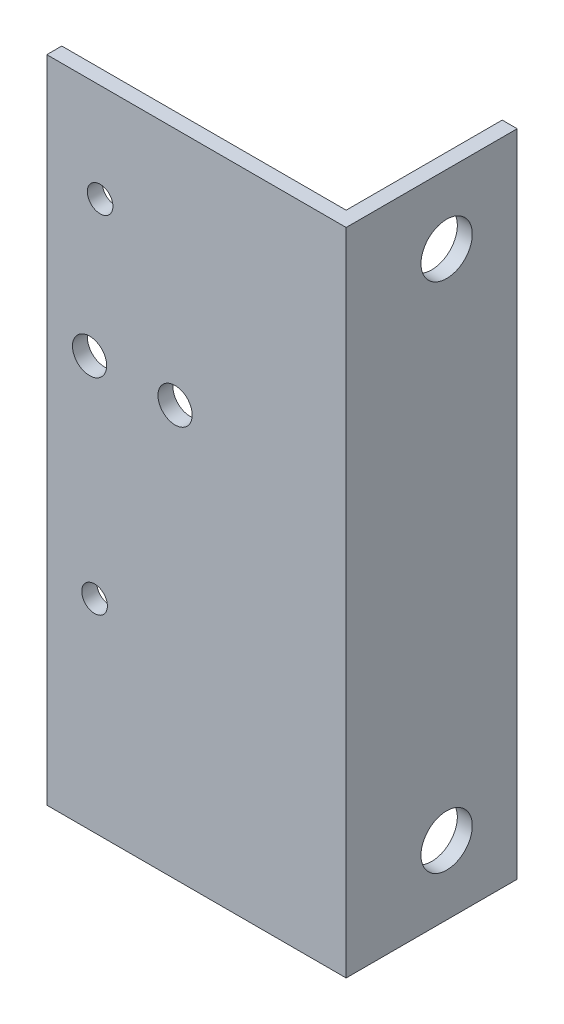
ISO-10303-21;
HEADER;
FILE_DESCRIPTION(('STEP AP214'),'2;1');
FILE_NAME('part.step','',(''),(''),'','','');
FILE_SCHEMA(('AUTOMOTIVE_DESIGN { 1 0 10303 214 1 1 1 1 }'));
ENDSEC;
DATA;
#1=APPLICATION_CONTEXT('core data for automotive mechanical design processes');
#2=APPLICATION_PROTOCOL_DEFINITION('international standard','automotive_design',2000,#1);
#3=PRODUCT_CONTEXT('',#1,'mechanical');
#4=PRODUCT('Part','Part','',(#3));
#5=PRODUCT_RELATED_PRODUCT_CATEGORY('part','',(#4));
#6=PRODUCT_DEFINITION_FORMATION('','',#4);
#7=PRODUCT_DEFINITION_CONTEXT('part definition',#1,'design');
#8=PRODUCT_DEFINITION('design','',#6,#7);
#9=PRODUCT_DEFINITION_SHAPE('','',#8);
#10=(LENGTH_UNIT() NAMED_UNIT(*) SI_UNIT(.MILLI.,.METRE.));
#11=(NAMED_UNIT(*) PLANE_ANGLE_UNIT() SI_UNIT($,.RADIAN.));
#12=(NAMED_UNIT(*) SI_UNIT($,.STERADIAN.) SOLID_ANGLE_UNIT());
#13=UNCERTAINTY_MEASURE_WITH_UNIT(LENGTH_MEASURE(1.E-05),#10,'distance_accuracy_value','');
#14=(GEOMETRIC_REPRESENTATION_CONTEXT(3) GLOBAL_UNCERTAINTY_ASSIGNED_CONTEXT((#13)) GLOBAL_UNIT_ASSIGNED_CONTEXT((#10,
#11,#12)) REPRESENTATION_CONTEXT('',''));
#15=CARTESIAN_POINT('',(0.,0.,0.));
#16=DIRECTION('',(0.,0.,1.));
#17=DIRECTION('',(1.,0.,0.));
#18=AXIS2_PLACEMENT_3D('',#15,#16,#17);
#19=CARTESIAN_POINT('',(0.,76.,1.75));
#20=DIRECTION('',(-1.,0.,0.));
#21=DIRECTION('',(0.,0.,1.));
#22=AXIS2_PLACEMENT_3D('',#19,#20,#21);
#23=PLANE('',#22);
#24=CARTESIAN_POINT('',(0.,67.9549999999984,-9.99999999999945));
#25=DIRECTION('',(-1.,0.,0.));
#26=DIRECTION('',(0.,0.,1.));
#27=AXIS2_PLACEMENT_3D('',#24,#25,#26);
#28=CIRCLE('',#27,3.);
#29=CARTESIAN_POINT('',(0.,67.9549999999984,-6.99999999999945));
#30=VERTEX_POINT('',#29);
#31=EDGE_CURVE('E200',#30,#30,#28,.F.);
#32=ORIENTED_EDGE('',*,*,#31,.F.);
#33=EDGE_LOOP('',(#32));
#34=FACE_BOUND('',#33,.T.);
#35=CARTESIAN_POINT('',(0.,8.05,-9.99999999999945));
#36=DIRECTION('',(-1.,0.,0.));
#37=DIRECTION('',(0.,0.,1.));
#38=AXIS2_PLACEMENT_3D('',#35,#36,#37);
#39=CIRCLE('',#38,3.);
#40=CARTESIAN_POINT('',(0.,8.05,-6.99999999999945));
#41=VERTEX_POINT('',#40);
#42=EDGE_CURVE('E149',#41,#41,#39,.F.);
#43=ORIENTED_EDGE('',*,*,#42,.F.);
#44=EDGE_LOOP('',(#43));
#45=FACE_BOUND('',#44,.T.);
#46=DIRECTION('',(0.,0.,-1.));
#47=VECTOR('',#46,1.);
#48=CARTESIAN_POINT('',(0.,0.,1.75));
#49=LINE('',#48,#47);
#50=CARTESIAN_POINT('',(0.,0.,1.75));
#51=VERTEX_POINT('',#50);
#52=CARTESIAN_POINT('',(0.,0.,-18.25));
#53=VERTEX_POINT('',#52);
#54=EDGE_CURVE('E144',#51,#53,#49,.T.);
#55=ORIENTED_EDGE('',*,*,#54,.T.);
#56=DIRECTION('',(0.,-1.,0.));
#57=VECTOR('',#56,1.);
#58=CARTESIAN_POINT('',(0.,76.,-18.25));
#59=LINE('',#58,#57);
#60=CARTESIAN_POINT('',(0.,76.,-18.25));
#61=VERTEX_POINT('',#60);
#62=EDGE_CURVE('E11',#61,#53,#59,.T.);
#63=ORIENTED_EDGE('',*,*,#62,.F.);
#64=DIRECTION('',(0.,0.,-1.));
#65=VECTOR('',#64,1.);
#66=CARTESIAN_POINT('',(0.,76.,1.75));
#67=LINE('',#66,#65);
#68=CARTESIAN_POINT('',(0.,76.,1.75));
#69=VERTEX_POINT('',#68);
#70=EDGE_CURVE('E160',#69,#61,#67,.T.);
#71=ORIENTED_EDGE('',*,*,#70,.F.);
#72=DIRECTION('',(0.,-1.,0.));
#73=VECTOR('',#72,1.);
#74=CARTESIAN_POINT('',(0.,76.,1.75));
#75=LINE('',#74,#73);
#76=EDGE_CURVE('E140',#69,#51,#75,.T.);
#77=ORIENTED_EDGE('',*,*,#76,.T.);
#78=EDGE_LOOP('',(#55,#63,#71,#77));
#79=FACE_BOUND('',#78,.T.);
#80=ADVANCED_FACE('F41',(#34,#45,#79),#23,.F.);
#81=CARTESIAN_POINT('',(-1.75,76.,-18.25));
#82=DIRECTION('',(0.,0.,1.));
#83=DIRECTION('',(1.,0.,0.));
#84=AXIS2_PLACEMENT_3D('',#81,#82,#83);
#85=PLANE('',#84);
#86=DIRECTION('',(-1.,0.,0.));
#87=VECTOR('',#86,1.);
#88=CARTESIAN_POINT('',(-1.75,0.,-18.25));
#89=LINE('',#88,#87);
#90=CARTESIAN_POINT('',(-1.75,0.,-18.25));
#91=VERTEX_POINT('',#90);
#92=EDGE_CURVE('E148',#53,#91,#89,.T.);
#93=ORIENTED_EDGE('',*,*,#92,.T.);
#94=DIRECTION('',(0.,-1.,0.));
#95=VECTOR('',#94,1.);
#96=CARTESIAN_POINT('',(-1.75,76.,-18.25));
#97=LINE('',#96,#95);
#98=CARTESIAN_POINT('',(-1.75,76.,-18.25));
#99=VERTEX_POINT('',#98);
#100=EDGE_CURVE('E50',#99,#91,#97,.T.);
#101=ORIENTED_EDGE('',*,*,#100,.F.);
#102=DIRECTION('',(-1.,0.,0.));
#103=VECTOR('',#102,1.);
#104=CARTESIAN_POINT('',(-1.75,76.,-18.25));
#105=LINE('',#104,#103);
#106=EDGE_CURVE('E106',#61,#99,#105,.T.);
#107=ORIENTED_EDGE('',*,*,#106,.F.);
#108=ORIENTED_EDGE('',*,*,#62,.T.);
#109=EDGE_LOOP('',(#93,#101,#107,#108));
#110=FACE_BOUND('',#109,.T.);
#111=ADVANCED_FACE('F192',(#110),#85,.F.);
#112=CARTESIAN_POINT('',(-1.75,76.,-18.25));
#113=DIRECTION('',(1.,0.,0.));
#114=DIRECTION('',(0.,0.,-1.));
#115=AXIS2_PLACEMENT_3D('',#112,#113,#114);
#116=PLANE('',#115);
#117=CARTESIAN_POINT('',(-1.75,67.9549999999984,-9.99999999999945));
#118=DIRECTION('',(-1.,0.,0.));
#119=DIRECTION('',(0.,0.,1.));
#120=AXIS2_PLACEMENT_3D('',#117,#118,#119);
#121=CIRCLE('',#120,3.);
#122=CARTESIAN_POINT('',(-1.75,67.9549999999984,-6.99999999999945));
#123=VERTEX_POINT('',#122);
#124=EDGE_CURVE('E217',#123,#123,#121,.T.);
#125=ORIENTED_EDGE('',*,*,#124,.F.);
#126=EDGE_LOOP('',(#125));
#127=FACE_BOUND('',#126,.T.);
#128=CARTESIAN_POINT('',(-1.75,8.05,-9.99999999999945));
#129=DIRECTION('',(-1.,0.,0.));
#130=DIRECTION('',(0.,0.,1.));
#131=AXIS2_PLACEMENT_3D('',#128,#129,#130);
#132=CIRCLE('',#131,3.);
#133=CARTESIAN_POINT('',(-1.75,8.05,-6.99999999999945));
#134=VERTEX_POINT('',#133);
#135=EDGE_CURVE('E205',#134,#134,#132,.T.);
#136=ORIENTED_EDGE('',*,*,#135,.F.);
#137=EDGE_LOOP('',(#136));
#138=FACE_BOUND('',#137,.T.);
#139=DIRECTION('',(0.,0.,1.));
#140=VECTOR('',#139,1.);
#141=CARTESIAN_POINT('',(-1.75,0.,-18.25));
#142=LINE('',#141,#140);
#143=CARTESIAN_POINT('',(-1.75,0.,0.));
#144=VERTEX_POINT('',#143);
#145=EDGE_CURVE('E151',#91,#144,#142,.T.);
#146=ORIENTED_EDGE('',*,*,#145,.T.);
#147=DIRECTION('',(0.,-1.,0.));
#148=VECTOR('',#147,1.);
#149=CARTESIAN_POINT('',(-1.75,76.,0.));
#150=LINE('',#149,#148);
#151=CARTESIAN_POINT('',(-1.75,76.,0.));
#152=VERTEX_POINT('',#151);
#153=EDGE_CURVE('E131',#152,#144,#150,.T.);
#154=ORIENTED_EDGE('',*,*,#153,.F.);
#155=DIRECTION('',(0.,0.,1.));
#156=VECTOR('',#155,1.);
#157=CARTESIAN_POINT('',(-1.75,76.,-18.25));
#158=LINE('',#157,#156);
#159=EDGE_CURVE('E120',#99,#152,#158,.T.);
#160=ORIENTED_EDGE('',*,*,#159,.F.);
#161=ORIENTED_EDGE('',*,*,#100,.T.);
#162=EDGE_LOOP('',(#146,#154,#160,#161));
#163=FACE_BOUND('',#162,.T.);
#164=ADVANCED_FACE('F171',(#127,#138,#163),#116,.F.);
#165=CARTESIAN_POINT('',(-35.,76.,0.));
#166=DIRECTION('',(0.,0.,1.));
#167=DIRECTION('',(1.,0.,0.));
#168=AXIS2_PLACEMENT_3D('',#165,#166,#167);
#169=PLANE('',#168);
#170=CARTESIAN_POINT('',(-20.,48.,0.));
#171=DIRECTION('',(0.,0.,1.));
#172=DIRECTION('',(1.,0.,0.));
#173=AXIS2_PLACEMENT_3D('',#170,#171,#172);
#174=CIRCLE('',#173,2.00000000000001);
#175=CARTESIAN_POINT('',(-18.,48.,0.));
#176=VERTEX_POINT('',#175);
#177=EDGE_CURVE('E246',#176,#176,#174,.F.);
#178=ORIENTED_EDGE('',*,*,#177,.F.);
#179=EDGE_LOOP('',(#178));
#180=FACE_BOUND('',#179,.T.);
#181=CARTESIAN_POINT('',(-30.,48.,0.));
#182=DIRECTION('',(0.,0.,1.));
#183=DIRECTION('',(1.,0.,0.));
#184=AXIS2_PLACEMENT_3D('',#181,#182,#183);
#185=CIRCLE('',#184,2.00000000000001);
#186=CARTESIAN_POINT('',(-28.,48.,0.));
#187=VERTEX_POINT('',#186);
#188=EDGE_CURVE('E238',#187,#187,#185,.F.);
#189=ORIENTED_EDGE('',*,*,#188,.F.);
#190=EDGE_LOOP('',(#189));
#191=FACE_BOUND('',#190,.T.);
#192=CARTESIAN_POINT('',(-29.41701924,23.7,0.));
#193=DIRECTION('',(0.,0.,1.));
#194=DIRECTION('',(1.,0.,0.));
#195=AXIS2_PLACEMENT_3D('',#192,#193,#194);
#196=CIRCLE('',#195,1.5);
#197=CARTESIAN_POINT('',(-27.91701924,23.7,0.));
#198=VERTEX_POINT('',#197);
#199=EDGE_CURVE('E230',#198,#198,#196,.F.);
#200=ORIENTED_EDGE('',*,*,#199,.F.);
#201=EDGE_LOOP('',(#200));
#202=FACE_BOUND('',#201,.T.);
#203=CARTESIAN_POINT('',(-28.76701924,64.5,0.));
#204=DIRECTION('',(0.,0.,1.));
#205=DIRECTION('',(1.,0.,0.));
#206=AXIS2_PLACEMENT_3D('',#203,#204,#205);
#207=CIRCLE('',#206,1.5);
#208=CARTESIAN_POINT('',(-27.26701924,64.5,0.));
#209=VERTEX_POINT('',#208);
#210=EDGE_CURVE('E220',#209,#209,#207,.F.);
#211=ORIENTED_EDGE('',*,*,#210,.F.);
#212=EDGE_LOOP('',(#211));
#213=FACE_BOUND('',#212,.T.);
#214=DIRECTION('',(-1.,0.,0.));
#215=VECTOR('',#214,1.);
#216=CARTESIAN_POINT('',(-35.,0.,0.));
#217=LINE('',#216,#215);
#218=CARTESIAN_POINT('',(-35.,0.,0.));
#219=VERTEX_POINT('',#218);
#220=EDGE_CURVE('E129',#144,#219,#217,.T.);
#221=ORIENTED_EDGE('',*,*,#220,.T.);
#222=DIRECTION('',(0.,-1.,0.));
#223=VECTOR('',#222,1.);
#224=CARTESIAN_POINT('',(-35.,76.,0.));
#225=LINE('',#224,#223);
#226=CARTESIAN_POINT('',(-35.,76.,0.));
#227=VERTEX_POINT('',#226);
#228=EDGE_CURVE('E126',#227,#219,#225,.T.);
#229=ORIENTED_EDGE('',*,*,#228,.F.);
#230=DIRECTION('',(-1.,0.,0.));
#231=VECTOR('',#230,1.);
#232=CARTESIAN_POINT('',(-35.,76.,0.));
#233=LINE('',#232,#231);
#234=EDGE_CURVE('E114',#152,#227,#233,.T.);
#235=ORIENTED_EDGE('',*,*,#234,.F.);
#236=ORIENTED_EDGE('',*,*,#153,.T.);
#237=EDGE_LOOP('',(#221,#229,#235,#236));
#238=FACE_BOUND('',#237,.T.);
#239=ADVANCED_FACE('F127',(#180,#191,#202,#213,#238),#169,.F.);
#240=CARTESIAN_POINT('',(-35.,76.,0.));
#241=DIRECTION('',(1.,0.,0.));
#242=DIRECTION('',(0.,0.,-1.));
#243=AXIS2_PLACEMENT_3D('',#240,#241,#242);
#244=PLANE('',#243);
#245=DIRECTION('',(0.,0.,1.));
#246=VECTOR('',#245,1.);
#247=CARTESIAN_POINT('',(-35.,0.,0.));
#248=LINE('',#247,#246);
#249=CARTESIAN_POINT('',(-35.,0.,1.75));
#250=VERTEX_POINT('',#249);
#251=EDGE_CURVE('E89',#219,#250,#248,.T.);
#252=ORIENTED_EDGE('',*,*,#251,.T.);
#253=DIRECTION('',(0.,-1.,0.));
#254=VECTOR('',#253,1.);
#255=CARTESIAN_POINT('',(-35.,76.,1.75));
#256=LINE('',#255,#254);
#257=CARTESIAN_POINT('',(-35.,76.,1.75));
#258=VERTEX_POINT('',#257);
#259=EDGE_CURVE('E132',#258,#250,#256,.T.);
#260=ORIENTED_EDGE('',*,*,#259,.F.);
#261=DIRECTION('',(0.,0.,1.));
#262=VECTOR('',#261,1.);
#263=CARTESIAN_POINT('',(-35.,76.,0.));
#264=LINE('',#263,#262);
#265=EDGE_CURVE('E118',#227,#258,#264,.T.);
#266=ORIENTED_EDGE('',*,*,#265,.F.);
#267=ORIENTED_EDGE('',*,*,#228,.T.);
#268=EDGE_LOOP('',(#252,#260,#266,#267));
#269=FACE_BOUND('',#268,.T.);
#270=ADVANCED_FACE('F134',(#269),#244,.F.);
#271=CARTESIAN_POINT('',(0.,76.,1.75));
#272=DIRECTION('',(0.,0.,-1.));
#273=DIRECTION('',(-1.,0.,0.));
#274=AXIS2_PLACEMENT_3D('',#271,#272,#273);
#275=PLANE('',#274);
#276=CARTESIAN_POINT('',(-20.,48.,1.75));
#277=DIRECTION('',(0.,0.,1.));
#278=DIRECTION('',(1.,0.,0.));
#279=AXIS2_PLACEMENT_3D('',#276,#277,#278);
#280=CIRCLE('',#279,2.00000000000001);
#281=CARTESIAN_POINT('',(-18.,48.,1.75));
#282=VERTEX_POINT('',#281);
#283=EDGE_CURVE('E249',#282,#282,#280,.T.);
#284=ORIENTED_EDGE('',*,*,#283,.F.);
#285=EDGE_LOOP('',(#284));
#286=FACE_BOUND('',#285,.T.);
#287=CARTESIAN_POINT('',(-30.,48.,1.75));
#288=DIRECTION('',(0.,0.,1.));
#289=DIRECTION('',(1.,0.,0.));
#290=AXIS2_PLACEMENT_3D('',#287,#288,#289);
#291=CIRCLE('',#290,2.00000000000001);
#292=CARTESIAN_POINT('',(-28.,48.,1.75));
#293=VERTEX_POINT('',#292);
#294=EDGE_CURVE('E242',#293,#293,#291,.T.);
#295=ORIENTED_EDGE('',*,*,#294,.F.);
#296=EDGE_LOOP('',(#295));
#297=FACE_BOUND('',#296,.T.);
#298=CARTESIAN_POINT('',(-29.41701924,23.7,1.75));
#299=DIRECTION('',(0.,0.,1.));
#300=DIRECTION('',(1.,0.,0.));
#301=AXIS2_PLACEMENT_3D('',#298,#299,#300);
#302=CIRCLE('',#301,1.5);
#303=CARTESIAN_POINT('',(-27.91701924,23.7,1.75));
#304=VERTEX_POINT('',#303);
#305=EDGE_CURVE('E234',#304,#304,#302,.T.);
#306=ORIENTED_EDGE('',*,*,#305,.F.);
#307=EDGE_LOOP('',(#306));
#308=FACE_BOUND('',#307,.T.);
#309=CARTESIAN_POINT('',(-28.76701924,64.5,1.75));
#310=DIRECTION('',(0.,0.,1.));
#311=DIRECTION('',(1.,0.,0.));
#312=AXIS2_PLACEMENT_3D('',#309,#310,#311);
#313=CIRCLE('',#312,1.5);
#314=CARTESIAN_POINT('',(-27.26701924,64.5,1.75));
#315=VERTEX_POINT('',#314);
#316=EDGE_CURVE('E226',#315,#315,#313,.T.);
#317=ORIENTED_EDGE('',*,*,#316,.F.);
#318=EDGE_LOOP('',(#317));
#319=FACE_BOUND('',#318,.T.);
#320=DIRECTION('',(1.,0.,0.));
#321=VECTOR('',#320,1.);
#322=CARTESIAN_POINT('',(0.,0.,1.75));
#323=LINE('',#322,#321);
#324=EDGE_CURVE('E96',#250,#51,#323,.T.);
#325=ORIENTED_EDGE('',*,*,#324,.T.);
#326=ORIENTED_EDGE('',*,*,#76,.F.);
#327=DIRECTION('',(1.,0.,0.));
#328=VECTOR('',#327,1.);
#329=CARTESIAN_POINT('',(0.,76.,1.75));
#330=LINE('',#329,#328);
#331=EDGE_CURVE('E60',#258,#69,#330,.T.);
#332=ORIENTED_EDGE('',*,*,#331,.F.);
#333=ORIENTED_EDGE('',*,*,#259,.T.);
#334=EDGE_LOOP('',(#325,#326,#332,#333));
#335=FACE_BOUND('',#334,.T.);
#336=ADVANCED_FACE('F178',(#286,#297,#308,#319,#335),#275,.F.);
#337=CARTESIAN_POINT('',(0.,76.,0.));
#338=DIRECTION('',(0.,-1.,0.));
#339=DIRECTION('',(0.,0.,-1.));
#340=AXIS2_PLACEMENT_3D('',#337,#338,#339);
#341=PLANE('',#340);
#342=ORIENTED_EDGE('',*,*,#70,.T.);
#343=ORIENTED_EDGE('',*,*,#106,.T.);
#344=ORIENTED_EDGE('',*,*,#159,.T.);
#345=ORIENTED_EDGE('',*,*,#234,.T.);
#346=ORIENTED_EDGE('',*,*,#265,.T.);
#347=ORIENTED_EDGE('',*,*,#331,.T.);
#348=EDGE_LOOP('',(#342,#343,#344,#345,#346,#347));
#349=FACE_BOUND('',#348,.T.);
#350=ADVANCED_FACE('F116',(#349),#341,.F.);
#351=CARTESIAN_POINT('',(0.,0.,0.));
#352=DIRECTION('',(0.,-1.,0.));
#353=DIRECTION('',(0.,0.,-1.));
#354=AXIS2_PLACEMENT_3D('',#351,#352,#353);
#355=PLANE('',#354);
#356=ORIENTED_EDGE('',*,*,#54,.F.);
#357=ORIENTED_EDGE('',*,*,#324,.F.);
#358=ORIENTED_EDGE('',*,*,#251,.F.);
#359=ORIENTED_EDGE('',*,*,#220,.F.);
#360=ORIENTED_EDGE('',*,*,#145,.F.);
#361=ORIENTED_EDGE('',*,*,#92,.F.);
#362=EDGE_LOOP('',(#356,#357,#358,#359,#360,#361));
#363=FACE_BOUND('',#362,.T.);
#364=ADVANCED_FACE('F174',(#363),#355,.T.);
#365=CARTESIAN_POINT('',(0.000999999999999916,8.05,-9.99999999999945));
#366=DIRECTION('',(-1.,0.,0.));
#367=DIRECTION('',(0.,0.,1.));
#368=AXIS2_PLACEMENT_3D('',#365,#366,#367);
#369=CYLINDRICAL_SURFACE('',#368,3.);
#370=ORIENTED_EDGE('',*,*,#135,.T.);
#371=EDGE_LOOP('',(#370));
#372=FACE_BOUND('',#371,.T.);
#373=ORIENTED_EDGE('',*,*,#42,.T.);
#374=EDGE_LOOP('',(#373));
#375=FACE_BOUND('',#374,.T.);
#376=ADVANCED_FACE('F281',(#372,#375),#369,.F.);
#377=CARTESIAN_POINT('',(0.000999999999999916,67.9549999999984,-9.99999999999945));
#378=DIRECTION('',(-1.,0.,0.));
#379=DIRECTION('',(0.,0.,1.));
#380=AXIS2_PLACEMENT_3D('',#377,#378,#379);
#381=CYLINDRICAL_SURFACE('',#380,3.);
#382=ORIENTED_EDGE('',*,*,#124,.T.);
#383=EDGE_LOOP('',(#382));
#384=FACE_BOUND('',#383,.T.);
#385=ORIENTED_EDGE('',*,*,#31,.T.);
#386=EDGE_LOOP('',(#385));
#387=FACE_BOUND('',#386,.T.);
#388=ADVANCED_FACE('F272',(#384,#387),#381,.F.);
#389=CARTESIAN_POINT('',(-28.76701924,64.5,-18.251));
#390=DIRECTION('',(0.,0.,1.));
#391=DIRECTION('',(1.,0.,0.));
#392=AXIS2_PLACEMENT_3D('',#389,#390,#391);
#393=CYLINDRICAL_SURFACE('',#392,1.5);
#394=ORIENTED_EDGE('',*,*,#316,.T.);
#395=EDGE_LOOP('',(#394));
#396=FACE_BOUND('',#395,.T.);
#397=ORIENTED_EDGE('',*,*,#210,.T.);
#398=EDGE_LOOP('',(#397));
#399=FACE_BOUND('',#398,.T.);
#400=ADVANCED_FACE('F269',(#396,#399),#393,.F.);
#401=CARTESIAN_POINT('',(-29.41701924,23.7,-18.251));
#402=DIRECTION('',(0.,0.,1.));
#403=DIRECTION('',(1.,0.,0.));
#404=AXIS2_PLACEMENT_3D('',#401,#402,#403);
#405=CYLINDRICAL_SURFACE('',#404,1.5);
#406=ORIENTED_EDGE('',*,*,#305,.T.);
#407=EDGE_LOOP('',(#406));
#408=FACE_BOUND('',#407,.T.);
#409=ORIENTED_EDGE('',*,*,#199,.T.);
#410=EDGE_LOOP('',(#409));
#411=FACE_BOUND('',#410,.T.);
#412=ADVANCED_FACE('F271',(#408,#411),#405,.F.);
#413=CARTESIAN_POINT('',(-30.,48.,-18.251));
#414=DIRECTION('',(0.,0.,1.));
#415=DIRECTION('',(1.,0.,0.));
#416=AXIS2_PLACEMENT_3D('',#413,#414,#415);
#417=CYLINDRICAL_SURFACE('',#416,2.00000000000001);
#418=ORIENTED_EDGE('',*,*,#294,.T.);
#419=EDGE_LOOP('',(#418));
#420=FACE_BOUND('',#419,.T.);
#421=ORIENTED_EDGE('',*,*,#188,.T.);
#422=EDGE_LOOP('',(#421));
#423=FACE_BOUND('',#422,.T.);
#424=ADVANCED_FACE('F256',(#420,#423),#417,.F.);
#425=CARTESIAN_POINT('',(-20.,48.,-18.251));
#426=DIRECTION('',(0.,0.,1.));
#427=DIRECTION('',(1.,0.,0.));
#428=AXIS2_PLACEMENT_3D('',#425,#426,#427);
#429=CYLINDRICAL_SURFACE('',#428,2.00000000000001);
#430=ORIENTED_EDGE('',*,*,#283,.T.);
#431=EDGE_LOOP('',(#430));
#432=FACE_BOUND('',#431,.T.);
#433=ORIENTED_EDGE('',*,*,#177,.T.);
#434=EDGE_LOOP('',(#433));
#435=FACE_BOUND('',#434,.T.);
#436=ADVANCED_FACE('F253',(#432,#435),#429,.F.);
#437=CLOSED_SHELL('',(#80,#111,#164,#239,#270,#336,#350,#364,#376,#388,#400,#412,#424,#436));
#438=MANIFOLD_SOLID_BREP('B2',#437);
#439=ADVANCED_BREP_SHAPE_REPRESENTATION('',(#18,#438),#14);
#440=SHAPE_DEFINITION_REPRESENTATION(#9,#439);
ENDSEC;
END-ISO-10303-21;
